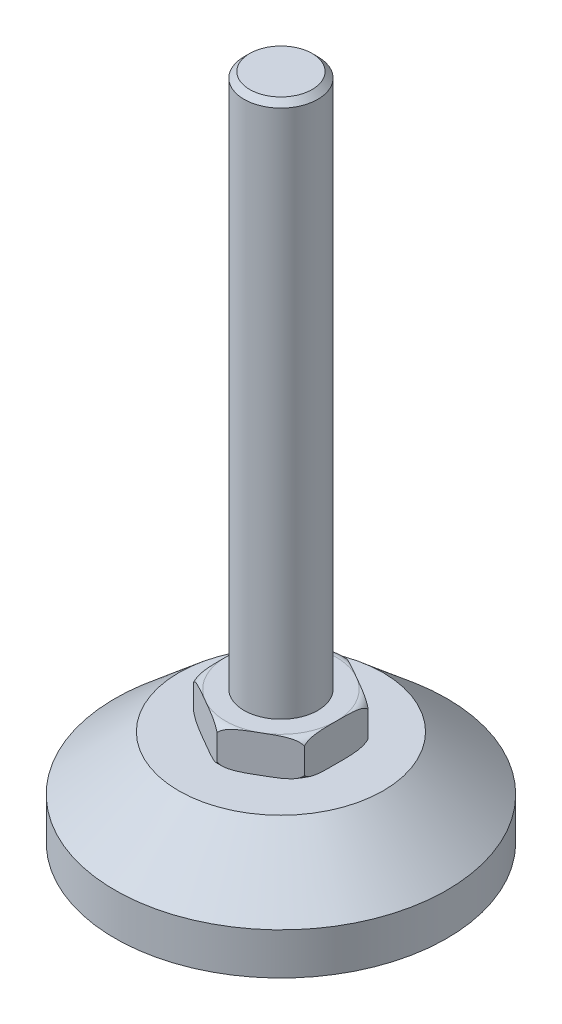
ISO-10303-21;
HEADER;
FILE_DESCRIPTION(('STEP AP214'),'2;1');
FILE_NAME('part.step','',(''),(''),'','','');
FILE_SCHEMA(('AUTOMOTIVE_DESIGN { 1 0 10303 214 1 1 1 1 }'));
ENDSEC;
DATA;
#1=APPLICATION_CONTEXT('core data for automotive mechanical design processes');
#2=APPLICATION_PROTOCOL_DEFINITION('international standard','automotive_design',2000,#1);
#3=PRODUCT_CONTEXT('',#1,'mechanical');
#4=PRODUCT('Part','Part','',(#3));
#5=PRODUCT_RELATED_PRODUCT_CATEGORY('part','',(#4));
#6=PRODUCT_DEFINITION_FORMATION('','',#4);
#7=PRODUCT_DEFINITION_CONTEXT('part definition',#1,'design');
#8=PRODUCT_DEFINITION('design','',#6,#7);
#9=PRODUCT_DEFINITION_SHAPE('','',#8);
#10=(LENGTH_UNIT() NAMED_UNIT(*) SI_UNIT(.MILLI.,.METRE.));
#11=(NAMED_UNIT(*) PLANE_ANGLE_UNIT() SI_UNIT($,.RADIAN.));
#12=(NAMED_UNIT(*) SI_UNIT($,.STERADIAN.) SOLID_ANGLE_UNIT());
#13=UNCERTAINTY_MEASURE_WITH_UNIT(LENGTH_MEASURE(1.E-05),#10,'distance_accuracy_value','');
#14=(GEOMETRIC_REPRESENTATION_CONTEXT(3) GLOBAL_UNCERTAINTY_ASSIGNED_CONTEXT((#13)) GLOBAL_UNIT_ASSIGNED_CONTEXT((#10,
#11,#12)) REPRESENTATION_CONTEXT('',''));
#15=CARTESIAN_POINT('',(0.,0.,0.));
#16=DIRECTION('',(0.,0.,1.));
#17=DIRECTION('',(1.,0.,0.));
#18=AXIS2_PLACEMENT_3D('',#15,#16,#17);
#19=CARTESIAN_POINT('',(0.,31.5,0.));
#20=DIRECTION('',(0.,-1.,0.));
#21=DIRECTION('',(0.,0.,-1.));
#22=AXIS2_PLACEMENT_3D('',#19,#20,#21);
#23=TOROIDAL_SURFACE('',#22,15.,2.5);
#24=CARTESIAN_POINT('',(-7.50000000000001,29.,-12.9903810567666));
#25=CARTESIAN_POINT('',(-8.96130139050577,29.,-12.1466983055909));
#26=CARTESIAN_POINT('',(-9.45168874238305,29.0056746595264,-11.8635730359774));
#27=CARTESIAN_POINT('',(-10.6339885096163,29.0193559843229,-11.1809719471024));
#28=CARTESIAN_POINT('',(-11.3995414098782,29.0890399843952,-10.7389797740573));
#29=CARTESIAN_POINT('',(-12.7132104172574,29.208615929015,-9.98053261902087));
#30=CARTESIAN_POINT('',(-13.580530579708,29.5478938005466,-9.47978508975643));
#31=CARTESIAN_POINT('',(-14.0128615715206,29.7170128237743,-9.2301786752544));
#32=CARTESIAN_POINT('',(-14.3513386318172,29.9459349697346,-9.03475885337765));
#33=CARTESIAN_POINT('',(-14.7576194955765,30.2207148532306,-8.80019248731963));
#34=CARTESIAN_POINT('',(-14.9999999999954,30.5698160017096,-8.66025403784707));
#35=B_SPLINE_CURVE_WITH_KNOTS('',2,(#24,#25,#26,#27,#28,#29,#30,#31,#32,#33,#34),.UNSPECIFIED.,
.F.,.F.,(3,2,2,2,2,3),(0.,0.25,0.5,0.785714285714286,0.892857142857143,1.),.UNSPECIFIED.);
#36=CARTESIAN_POINT('',(-7.5,29.,-12.9903810567666));
#37=VERTEX_POINT('',#36);
#38=CARTESIAN_POINT('',(-15.,30.5698160017029,-8.66025403784439));
#39=VERTEX_POINT('',#38);
#40=EDGE_CURVE('E358',#37,#39,#35,.T.);
#41=ORIENTED_EDGE('',*,*,#40,.F.);
#42=CARTESIAN_POINT('',(0.,29.,0.));
#43=DIRECTION('',(0.,-1.,0.));
#44=DIRECTION('',(0.,0.,-1.));
#45=AXIS2_PLACEMENT_3D('',#42,#43,#44);
#46=CIRCLE('',#45,15.);
#47=CARTESIAN_POINT('',(-15.,29.,0.));
#48=VERTEX_POINT('',#47);
#49=EDGE_CURVE('E638',#48,#37,#46,.T.);
#50=ORIENTED_EDGE('',*,*,#49,.F.);
#51=CARTESIAN_POINT('',(-15.,30.5698160017082,-8.66025403783797));
#52=CARTESIAN_POINT('',(-15.,30.1235587743501,-8.30248641241119));
#53=CARTESIAN_POINT('',(-15.,29.796986819349,-7.6325941078365));
#54=CARTESIAN_POINT('',(-15.,29.5436425126361,-7.11291261383249));
#55=CARTESIAN_POINT('',(-15.,29.3732258924531,-6.41584851671963));
#56=CARTESIAN_POINT('',(-15.,29.1765293571952,-5.61129029576918));
#57=CARTESIAN_POINT('',(-15.,29.0891008871721,-4.50357468180429));
#58=CARTESIAN_POINT('',(-15.,29.019380151676,-3.6202154361742));
#59=CARTESIAN_POINT('',(-15.,29.0056706848194,-2.25321956097198));
#60=CARTESIAN_POINT('',(-15.,28.9999999999998,-1.68778526370712));
#61=CARTESIAN_POINT('',(-15.,28.9999999999998,0.));
#62=B_SPLINE_CURVE_WITH_KNOTS('',2,(#51,#52,#53,#54,#55,#56,#57,#58,#59,#60,#61),.UNSPECIFIED.,
.F.,.F.,(3,2,2,2,2,3),(0.,0.142857142857143,0.285714285714286,0.5,0.75,1.),.UNSPECIFIED.);
#63=EDGE_CURVE('E658',#39,#48,#62,.T.);
#64=ORIENTED_EDGE('',*,*,#63,.F.);
#65=EDGE_LOOP('',(#41,#50,#64));
#66=FACE_BOUND('',#65,.T.);
#67=ADVANCED_FACE('F41',(#66),#23,.T.);
#68=CARTESIAN_POINT('',(15.,29.,8.66025403784439));
#69=DIRECTION('',(1.,0.,0.));
#70=DIRECTION('',(0.,1.,0.));
#71=AXIS2_PLACEMENT_3D('',#68,#69,#70);
#72=PLANE('',#71);
#73=CARTESIAN_POINT('',(15.,37.4301839982891,-8.66025403784011));
#74=CARTESIAN_POINT('',(15.,37.8764412256418,-8.30248641241896));
#75=CARTESIAN_POINT('',(15.,38.2030131806497,-7.63259410783916));
#76=CARTESIAN_POINT('',(15.,38.4563574873402,-7.11291261388801));
#77=CARTESIAN_POINT('',(15.,38.6267741075463,-6.41584851672196));
#78=CARTESIAN_POINT('',(15.,38.82347064278,-5.61129029591879));
#79=CARTESIAN_POINT('',(15.,38.9108991128277,-4.50357468180597));
#80=CARTESIAN_POINT('',(15.,38.9806198483089,-3.62021543649595));
#81=CARTESIAN_POINT('',(15.,38.9943293151806,-2.25321956097277));
#82=CARTESIAN_POINT('',(15.,39.0000000000002,-1.68778526420001));
#83=CARTESIAN_POINT('',(15.,39.0000000000002,0.));
#84=B_SPLINE_CURVE_WITH_KNOTS('',2,(#73,#74,#75,#76,#77,#78,#79,#80,#81,#82,#83),.UNSPECIFIED.,
.F.,.F.,(3,2,2,2,2,3),(0.,0.142857142857143,0.285714285714286,0.5,0.75,1.),.UNSPECIFIED.);
#85=CARTESIAN_POINT('',(14.9999999999908,37.4301839982971,-8.66025403784971));
#86=VERTEX_POINT('',#85);
#87=CARTESIAN_POINT('',(15.,39.,0.));
#88=VERTEX_POINT('',#87);
#89=EDGE_CURVE('E668',#86,#88,#84,.T.);
#90=ORIENTED_EDGE('',*,*,#89,.T.);
#91=CARTESIAN_POINT('',(15.,39.0000000000002,0.));
#92=CARTESIAN_POINT('',(15.,39.0000000000002,1.68868131309375));
#93=CARTESIAN_POINT('',(15.,38.9943077207282,2.25537113221989));
#94=CARTESIAN_POINT('',(15.,38.9877600626021,2.9072174352275));
#95=CARTESIAN_POINT('',(15.,38.9718431618494,3.38252569359753));
#96=CARTESIAN_POINT('',(15.,38.9514689066876,3.9909388443159));
#97=CARTESIAN_POINT('',(15.,38.9104997438894,4.50862793481098));
#98=CARTESIAN_POINT('',(15.,38.8550176895906,5.20970289624456));
#99=CARTESIAN_POINT('',(15.,38.7555933813465,5.78851901899738));
#100=CARTESIAN_POINT('',(15.,38.6367099523602,6.48061984062342));
#101=CARTESIAN_POINT('',(15.,38.4477255875539,7.03388595719448));
#102=CARTESIAN_POINT('',(15.,38.2773364383082,7.53271316443804));
#103=CARTESIAN_POINT('',(15.,38.0500738681571,7.91781339707679));
#104=CARTESIAN_POINT('',(15.,37.7751322828114,8.38370651976896));
#105=CARTESIAN_POINT('',(15.,37.4301839982838,8.66025403784439));
#106=B_SPLINE_CURVE_WITH_KNOTS('',2,(#91,#92,#93,#94,#95,#96,#97,#98,#99,#100,#101,#102,#103,
#104,#105),.UNSPECIFIED.,.F.,.F.,(3,2,2,2,2,2,2,3),(0.,0.25,0.375,0.5,0.642857142857143,
0.785714285714286,0.892857142857143,1.),.UNSPECIFIED.);
#107=CARTESIAN_POINT('',(15.,37.4301839982838,8.66025403784439));
#108=VERTEX_POINT('',#107);
#109=EDGE_CURVE('E520',#88,#108,#106,.T.);
#110=ORIENTED_EDGE('',*,*,#109,.T.);
#111=DIRECTION('',(0.,1.,0.));
#112=VECTOR('',#111,1.);
#113=CARTESIAN_POINT('',(15.,29.,8.66025403784439));
#114=LINE('',#113,#112);
#115=CARTESIAN_POINT('',(15.,30.5698160017164,8.66025403784451));
#116=VERTEX_POINT('',#115);
#117=EDGE_CURVE('E430',#116,#108,#114,.T.);
#118=ORIENTED_EDGE('',*,*,#117,.F.);
#119=CARTESIAN_POINT('',(15.,30.5698160017164,8.66025403784451));
#120=CARTESIAN_POINT('',(15.,30.1235587743544,8.30248641241847));
#121=CARTESIAN_POINT('',(15.,29.7969868193529,7.63259410784463));
#122=CARTESIAN_POINT('',(15.,29.5436425126525,7.1129126138674));
#123=CARTESIAN_POINT('',(15.,29.3732258924549,6.41584851672692));
#124=CARTESIAN_POINT('',(15.,29.1765293571993,5.61129029582287));
#125=CARTESIAN_POINT('',(15.,29.0891008871726,4.50357468180956));
#126=CARTESIAN_POINT('',(15.,29.0193801516759,3.62021543617154));
#127=CARTESIAN_POINT('',(15.,29.0056706848194,2.2532195609746));
#128=CARTESIAN_POINT('',(15.,28.9999999999998,1.68778526370629));
#129=CARTESIAN_POINT('',(15.,28.9999999999998,0.));
#130=B_SPLINE_CURVE_WITH_KNOTS('',2,(#119,#120,#121,#122,#123,#124,#125,#126,#127,#128,#129),
.UNSPECIFIED.,.F.,.F.,(3,2,2,2,2,3),(0.,0.142857142857143,0.285714285714286,0.5,0.75,1.),.UNSPECIFIED.);
#131=CARTESIAN_POINT('',(15.,29.,0.));
#132=VERTEX_POINT('',#131);
#133=EDGE_CURVE('E51',#116,#132,#130,.T.);
#134=ORIENTED_EDGE('',*,*,#133,.T.);
#135=CARTESIAN_POINT('',(15.,28.9999999999998,0.));
#136=CARTESIAN_POINT('',(15.,28.9999999999998,-1.68868131309341));
#137=CARTESIAN_POINT('',(15.,29.0056922792719,-2.25537113221989));
#138=CARTESIAN_POINT('',(15.,29.0122399373947,-2.90721743490585));
#139=CARTESIAN_POINT('',(15.,29.0281568381505,-3.38252569359753));
#140=CARTESIAN_POINT('',(15.,29.0485310932981,-3.99093884417661));
#141=CARTESIAN_POINT('',(15.,29.0895002561106,-4.50862793481097));
#142=CARTESIAN_POINT('',(15.,29.1449823104177,-5.20970289629233));
#143=CARTESIAN_POINT('',(15.,29.2444066186536,-5.78851901899739));
#144=CARTESIAN_POINT('',(15.,29.3632900476379,-6.48061984061286));
#145=CARTESIAN_POINT('',(15.,29.5522744124461,-7.03388595719446));
#146=CARTESIAN_POINT('',(15.,29.7226635616862,-7.53271316442616));
#147=CARTESIAN_POINT('',(15.,29.9499261318429,-7.91781339707681));
#148=CARTESIAN_POINT('',(15.,30.2248677171852,-8.38370651976601));
#149=CARTESIAN_POINT('',(15.,30.5698160017162,-8.66025403784441));
#150=B_SPLINE_CURVE_WITH_KNOTS('',2,(#135,#136,#137,#138,#139,#140,#141,#142,#143,#144,#145,
#146,#147,#148,#149),.UNSPECIFIED.,.F.,.F.,(3,2,2,2,2,2,2,3),(0.,0.25,0.375,0.5,
0.642857142857143,0.785714285714286,0.892857142857143,1.),.UNSPECIFIED.);
#151=CARTESIAN_POINT('',(15.,30.5698160017162,-8.66025403784439));
#152=VERTEX_POINT('',#151);
#153=EDGE_CURVE('E12',#132,#152,#150,.T.);
#154=ORIENTED_EDGE('',*,*,#153,.T.);
#155=DIRECTION('',(0.,1.,0.));
#156=VECTOR('',#155,1.);
#157=CARTESIAN_POINT('',(15.,29.,-8.66025403784439));
#158=LINE('',#157,#156);
#159=EDGE_CURVE('E927',#152,#86,#158,.T.);
#160=ORIENTED_EDGE('',*,*,#159,.T.);
#161=EDGE_LOOP('',(#90,#110,#118,#134,#154,#160));
#162=FACE_BOUND('',#161,.T.);
#163=ADVANCED_FACE('F341',(#162),#72,.T.);
#164=CARTESIAN_POINT('',(-15.,29.,8.66025403784439));
#165=DIRECTION('',(-0.5,0.,0.866025403784439));
#166=DIRECTION('',(0.,1.,0.));
#167=AXIS2_PLACEMENT_3D('',#164,#165,#166);
#168=PLANE('',#167);
#169=DIRECTION('',(0.,1.,0.));
#170=VECTOR('',#169,1.);
#171=CARTESIAN_POINT('',(0.,29.,17.3205080756888));
#172=LINE('',#171,#170);
#173=CARTESIAN_POINT('',(0.,30.5698160017031,17.3205080756835));
#174=VERTEX_POINT('',#173);
#175=CARTESIAN_POINT('',(0.,37.430183998297,17.3205080756835));
#176=VERTEX_POINT('',#175);
#177=EDGE_CURVE('E612',#174,#176,#172,.T.);
#178=ORIENTED_EDGE('',*,*,#177,.T.);
#179=CARTESIAN_POINT('',(-1.87523607753093E-12,37.4301839982946,17.3205080756877));
#180=CARTESIAN_POINT('',(-0.309841605455377,37.8764495119477,17.141620941373));
#181=CARTESIAN_POINT('',(-0.892990092455252,38.2048222598795,16.8049400054261));
#182=CARTESIAN_POINT('',(-1.34394496490091,38.4587563675029,16.5445810884272));
#183=CARTESIAN_POINT('',(-1.9503072146466,38.6284041186055,16.1944976803101));
#184=CARTESIAN_POINT('',(-2.65306012488065,38.8250200043273,15.7887630984127));
#185=CARTESIAN_POINT('',(-3.60577548879402,38.911443157457,15.2387126265962));
#186=CARTESIAN_POINT('',(-4.05122123702597,38.9518506365097,14.9815344039451));
#187=CARTESIAN_POINT('',(-4.57715634103826,38.9720749648833,14.6778856300673));
#188=CARTESIAN_POINT('',(-4.98741035674131,38.9878508883135,14.441025363665));
#189=CARTESIAN_POINT('',(-5.55070792674983,38.9943530405408,14.1158053599868));
#190=CARTESIAN_POINT('',(-5.84799923241022,38.997784678503,13.944164144636));
#191=CARTESIAN_POINT('',(-6.20031205747897,38.9991469859418,13.7407562402436));
#192=CARTESIAN_POINT('',(-6.42091409200853,39.,13.6133915962242));
#193=CARTESIAN_POINT('',(-7.49999999999998,39.,12.9903810567666));
#194=B_SPLINE_CURVE_WITH_KNOTS('',2,(#179,#180,#181,#182,#183,#184,#185,#186,#187,#188,#189,
#190,#191,#192,#193),.UNSPECIFIED.,.F.,.F.,(3,2,2,2,2,2,2,3),(0.,0.142857142857143,
0.285714285714286,0.5,0.625,0.75,0.833333333333333,1.),.UNSPECIFIED.);
#195=CARTESIAN_POINT('',(-7.5,39.,12.9903810567666));
#196=VERTEX_POINT('',#195);
#197=EDGE_CURVE('E513',#176,#196,#194,.T.);
#198=ORIENTED_EDGE('',*,*,#197,.T.);
#199=CARTESIAN_POINT('',(-7.49999999999998,39.,12.9903810567666));
#200=CARTESIAN_POINT('',(-8.96130138988979,39.,12.1466983059465));
#201=CARTESIAN_POINT('',(-9.45168874238303,38.9943253404737,11.8635730359774));
#202=CARTESIAN_POINT('',(-10.6339885094595,38.9806440156962,11.180971947193));
#203=CARTESIAN_POINT('',(-11.3995414098781,38.9109600156048,10.7389797740574));
#204=CARTESIAN_POINT('',(-12.7132104172455,38.7913840709778,9.98053261902774));
#205=CARTESIAN_POINT('',(-13.5805305797077,38.4521061994536,9.4797850897566));
#206=CARTESIAN_POINT('',(-14.0128615715187,38.2829871762324,9.23017867525549));
#207=CARTESIAN_POINT('',(-14.351338631817,38.0540650302656,9.03475885337775));
#208=CARTESIAN_POINT('',(-14.7576194955849,37.7792851467572,8.80019248731476));
#209=CARTESIAN_POINT('',(-14.9999999999954,37.4301839982904,8.66025403784705));
#210=B_SPLINE_CURVE_WITH_KNOTS('',2,(#199,#200,#201,#202,#203,#204,#205,#206,#207,#208,#209),
.UNSPECIFIED.,.F.,.F.,(3,2,2,2,2,3),(0.,0.25,0.5,0.785714285714286,0.892857142857143,1.),.UNSPECIFIED.);
#211=CARTESIAN_POINT('',(-15.,37.4301839982836,8.6602540378445));
#212=VERTEX_POINT('',#211);
#213=EDGE_CURVE('E276',#196,#212,#210,.T.);
#214=ORIENTED_EDGE('',*,*,#213,.T.);
#215=DIRECTION('',(0.,1.,0.));
#216=VECTOR('',#215,1.);
#217=CARTESIAN_POINT('',(-15.,29.,8.66025403784439));
#218=LINE('',#217,#216);
#219=CARTESIAN_POINT('',(-15.,30.5698160017162,8.66025403784439));
#220=VERTEX_POINT('',#219);
#221=EDGE_CURVE('E514',#220,#212,#218,.T.);
#222=ORIENTED_EDGE('',*,*,#221,.F.);
#223=CARTESIAN_POINT('',(-14.9999999999916,30.5698160017041,8.66025403784924));
#224=CARTESIAN_POINT('',(-14.690158394569,30.1235504880725,8.83914117214613));
#225=CARTESIAN_POINT('',(-14.1070099075446,29.7951777401203,9.17582210810721));
#226=CARTESIAN_POINT('',(-13.6560550351455,29.5412436325182,9.43618102507918));
#227=CARTESIAN_POINT('',(-13.0496927853532,29.3715958813944,9.78626443322318));
#228=CARTESIAN_POINT('',(-12.3469398751431,29.1749799956699,10.1919990151068));
#229=CARTESIAN_POINT('',(-11.3942245112058,29.0885568425429,10.7420494869371));
#230=CARTESIAN_POINT('',(-10.9487787630079,29.0481493634957,10.9992277095685));
#231=CARTESIAN_POINT('',(-10.4228436589616,29.0279250351167,11.3028764834659));
#232=CARTESIAN_POINT('',(-10.0125896435164,29.0121491116932,11.5397367497193));
#233=CARTESIAN_POINT('',(-9.44929207325009,29.0056469594592,11.8649567535464));
#234=CARTESIAN_POINT('',(-9.15200076835931,29.0022153215039,12.0365979684529));
#235=CARTESIAN_POINT('',(-8.79968794252098,29.0008530140582,12.2400058732896));
#236=CARTESIAN_POINT('',(-8.57908590863338,29.,12.3673705169384));
#237=CARTESIAN_POINT('',(-7.49999999999998,29.,12.9903810567666));
#238=B_SPLINE_CURVE_WITH_KNOTS('',2,(#223,#224,#225,#226,#227,#228,#229,#230,#231,#232,#233,
#234,#235,#236,#237),.UNSPECIFIED.,.F.,.F.,(3,2,2,2,2,2,2,3),(0.,0.142857142857143,
0.285714285714286,0.5,0.625,0.75,0.833333333333333,1.),.UNSPECIFIED.);
#239=CARTESIAN_POINT('',(-7.5,29.,12.9903810567666));
#240=VERTEX_POINT('',#239);
#241=EDGE_CURVE('E622',#220,#240,#238,.T.);
#242=ORIENTED_EDGE('',*,*,#241,.T.);
#243=CARTESIAN_POINT('',(-7.49999999999998,29.,12.9903810567666));
#244=CARTESIAN_POINT('',(-6.03869861010004,29.,13.8340638075925));
#245=CARTESIAN_POINT('',(-5.54831125761696,29.0056746595263,14.1171890775558));
#246=CARTESIAN_POINT('',(-4.36601149051444,29.0193559843044,14.7997901663553));
#247=CARTESIAN_POINT('',(-3.60045859012182,29.0890399843952,15.2417823394758));
#248=CARTESIAN_POINT('',(-2.28678958276282,29.2086159290245,16.0002294945006));
#249=CARTESIAN_POINT('',(-1.41946942029201,29.5478938005466,16.5009770237767));
#250=CARTESIAN_POINT('',(-0.987138428498457,29.7170128237581,16.7505834382678));
#251=CARTESIAN_POINT('',(-0.648661368182727,29.9459349697346,16.9460032601556));
#252=CARTESIAN_POINT('',(-0.242380504419616,30.220714853237,17.1805696262158));
#253=CARTESIAN_POINT('',(-1.13971332371676E-12,30.5698160017096,17.3205080756881));
#254=B_SPLINE_CURVE_WITH_KNOTS('',2,(#243,#244,#245,#246,#247,#248,#249,#250,#251,#252,#253),
.UNSPECIFIED.,.F.,.F.,(3,2,2,2,2,3),(0.,0.25,0.5,0.785714285714286,0.892857142857143,1.),.UNSPECIFIED.);
#255=EDGE_CURVE('E450',#240,#174,#254,.T.);
#256=ORIENTED_EDGE('',*,*,#255,.T.);
#257=EDGE_LOOP('',(#178,#198,#214,#222,#242,#256));
#258=FACE_BOUND('',#257,.T.);
#259=ADVANCED_FACE('F457',(#258),#168,.T.);
#260=CARTESIAN_POINT('',(0.,31.5,0.));
#261=DIRECTION('',(0.,-1.,0.));
#262=DIRECTION('',(0.,0.,-1.));
#263=AXIS2_PLACEMENT_3D('',#260,#261,#262);
#264=TOROIDAL_SURFACE('',#263,15.,2.5);
#265=CARTESIAN_POINT('',(0.,29.,0.));
#266=DIRECTION('',(0.,-1.,0.));
#267=DIRECTION('',(0.,0.,-1.));
#268=AXIS2_PLACEMENT_3D('',#265,#266,#267);
#269=CIRCLE('',#268,15.);
#270=CARTESIAN_POINT('',(7.5,29.,-12.9903810567666));
#271=VERTEX_POINT('',#270);
#272=EDGE_CURVE('E639',#271,#132,#269,.T.);
#273=ORIENTED_EDGE('',*,*,#272,.F.);
#274=CARTESIAN_POINT('',(14.9999999999916,30.5698160017041,-8.66025403784924));
#275=CARTESIAN_POINT('',(14.690158394569,30.1235504880725,-8.83914117214613));
#276=CARTESIAN_POINT('',(14.1070099075446,29.7951777401203,-9.17582210810721));
#277=CARTESIAN_POINT('',(13.6560550351456,29.5412436325182,-9.43618102507913));
#278=CARTESIAN_POINT('',(13.0496927853532,29.3715958813944,-9.78626443322318));
#279=CARTESIAN_POINT('',(12.346939875143,29.1749799956699,-10.1919990151068));
#280=CARTESIAN_POINT('',(11.3942245112058,29.0885568425429,-10.7420494869371));
#281=CARTESIAN_POINT('',(10.9487787630079,29.0481493634957,-10.9992277095685));
#282=CARTESIAN_POINT('',(10.4228436589616,29.0279250351167,-11.3028764834659));
#283=CARTESIAN_POINT('',(10.0125896435164,29.0121491116932,-11.5397367497193));
#284=CARTESIAN_POINT('',(9.44929207325009,29.0056469594592,-11.8649567535464));
#285=CARTESIAN_POINT('',(9.15200076835931,29.0022153215039,-12.0365979684529));
#286=CARTESIAN_POINT('',(8.79968794252098,29.0008530140582,-12.2400058732896));
#287=CARTESIAN_POINT('',(8.57908590863338,29.,-12.3673705169384));
#288=CARTESIAN_POINT('',(7.49999999999998,29.,-12.9903810567666));
#289=B_SPLINE_CURVE_WITH_KNOTS('',2,(#274,#275,#276,#277,#278,#279,#280,#281,#282,#283,#284,
#285,#286,#287,#288),.UNSPECIFIED.,.F.,.F.,(3,2,2,2,2,2,2,3),(0.,0.142857142857143,
0.285714285714286,0.5,0.625,0.75,0.833333333333333,1.),.UNSPECIFIED.);
#290=EDGE_CURVE('E377',#152,#271,#289,.T.);
#291=ORIENTED_EDGE('',*,*,#290,.F.);
#292=ORIENTED_EDGE('',*,*,#153,.F.);
#293=EDGE_LOOP('',(#273,#291,#292));
#294=FACE_BOUND('',#293,.T.);
#295=ADVANCED_FACE('F467',(#294),#264,.T.);
#296=CARTESIAN_POINT('',(0.,31.5,0.));
#297=DIRECTION('',(0.,-1.,0.));
#298=DIRECTION('',(0.,0.,-1.));
#299=AXIS2_PLACEMENT_3D('',#296,#297,#298);
#300=TOROIDAL_SURFACE('',#299,15.,2.5);
#301=CARTESIAN_POINT('',(0.,29.,0.));
#302=DIRECTION('',(0.,-1.,0.));
#303=DIRECTION('',(0.,0.,-1.));
#304=AXIS2_PLACEMENT_3D('',#301,#302,#303);
#305=CIRCLE('',#304,15.);
#306=CARTESIAN_POINT('',(7.5,29.,12.9903810567666));
#307=VERTEX_POINT('',#306);
#308=EDGE_CURVE('E632',#132,#307,#305,.T.);
#309=ORIENTED_EDGE('',*,*,#308,.F.);
#310=ORIENTED_EDGE('',*,*,#133,.F.);
#311=CARTESIAN_POINT('',(7.50000000000001,29.,12.9903810567666));
#312=CARTESIAN_POINT('',(8.961301390667,29.,12.1466983054978));
#313=CARTESIAN_POINT('',(9.45168874238305,29.0056746595264,11.8635730359774));
#314=CARTESIAN_POINT('',(10.6339885097544,29.019355984329,11.1809719470227));
#315=CARTESIAN_POINT('',(11.3995414098782,29.0890399843952,10.7389797740573));
#316=CARTESIAN_POINT('',(12.7132104172981,29.2086159290298,9.98053261899738));
#317=CARTESIAN_POINT('',(13.580530579708,29.5478938005466,9.47978508975645));
#318=CARTESIAN_POINT('',(14.0128615715255,29.7170128237767,9.2301786752516));
#319=CARTESIAN_POINT('',(14.3513386318172,29.9459349697346,9.03475885337765));
#320=CARTESIAN_POINT('',(14.7576194955778,30.2207148532325,8.80019248731887));
#321=CARTESIAN_POINT('',(14.9999999999954,30.5698160017096,8.66025403784707));
#322=B_SPLINE_CURVE_WITH_KNOTS('',2,(#311,#312,#313,#314,#315,#316,#317,#318,#319,#320,#321),
.UNSPECIFIED.,.F.,.F.,(3,2,2,2,2,3),(0.,0.25,0.5,0.785714285714286,0.892857142857143,1.),.UNSPECIFIED.);
#323=EDGE_CURVE('E329',#307,#116,#322,.T.);
#324=ORIENTED_EDGE('',*,*,#323,.F.);
#325=EDGE_LOOP('',(#309,#310,#324));
#326=FACE_BOUND('',#325,.T.);
#327=ADVANCED_FACE('F564',(#326),#300,.T.);
#328=CARTESIAN_POINT('',(0.,31.5,0.));
#329=DIRECTION('',(0.,-1.,0.));
#330=DIRECTION('',(0.,0.,-1.));
#331=AXIS2_PLACEMENT_3D('',#328,#329,#330);
#332=TOROIDAL_SURFACE('',#331,15.,2.5);
#333=CARTESIAN_POINT('',(0.,29.,0.));
#334=DIRECTION('',(0.,-1.,0.));
#335=DIRECTION('',(0.,0.,-1.));
#336=AXIS2_PLACEMENT_3D('',#333,#334,#335);
#337=CIRCLE('',#336,15.);
#338=EDGE_CURVE('E157',#307,#240,#337,.T.);
#339=ORIENTED_EDGE('',*,*,#338,.F.);
#340=CARTESIAN_POINT('',(1.73179315369426E-12,30.5698160017064,17.3205080756878));
#341=CARTESIAN_POINT('',(0.309841605447004,30.1235504880625,17.1416209413778));
#342=CARTESIAN_POINT('',(0.892990092455255,29.7951777401205,16.8049400054261));
#343=CARTESIAN_POINT('',(1.34394496489584,29.5412436324957,16.5445810884301));
#344=CARTESIAN_POINT('',(1.9503072146466,29.3715958813945,16.1944976803101));
#345=CARTESIAN_POINT('',(2.65306012488285,29.1749799956754,15.7887630984114));
#346=CARTESIAN_POINT('',(3.60577548879403,29.088556842543,15.2387126265962));
#347=CARTESIAN_POINT('',(4.05122123700344,29.0481493634911,14.9815344039581));
#348=CARTESIAN_POINT('',(4.57715634103827,29.0279250351167,14.6778856300674));
#349=CARTESIAN_POINT('',(4.98741035666497,29.0121491116895,14.4410253637092));
#350=CARTESIAN_POINT('',(5.55070792674984,29.0056469594592,14.1158053599868));
#351=CARTESIAN_POINT('',(5.84799923191412,29.0022153215016,13.9441641449225));
#352=CARTESIAN_POINT('',(6.20031205747898,29.0008530140582,13.7407562402436));
#353=CARTESIAN_POINT('',(6.42091409156896,29.,13.613391596478));
#354=CARTESIAN_POINT('',(7.50000000000001,29.,12.9903810567666));
#355=B_SPLINE_CURVE_WITH_KNOTS('',2,(#340,#341,#342,#343,#344,#345,#346,#347,#348,#349,#350,
#351,#352,#353,#354),.UNSPECIFIED.,.F.,.F.,(3,2,2,2,2,2,2,3),(0.,0.142857142857143,
0.285714285714286,0.5,0.625,0.75,0.833333333333333,1.),.UNSPECIFIED.);
#356=EDGE_CURVE('E613',#174,#307,#355,.T.);
#357=ORIENTED_EDGE('',*,*,#356,.F.);
#358=ORIENTED_EDGE('',*,*,#255,.F.);
#359=EDGE_LOOP('',(#339,#357,#358));
#360=FACE_BOUND('',#359,.T.);
#361=ADVANCED_FACE('F566',(#360),#332,.T.);
#362=CARTESIAN_POINT('',(0.,31.5,0.));
#363=DIRECTION('',(0.,-1.,0.));
#364=DIRECTION('',(0.,0.,-1.));
#365=AXIS2_PLACEMENT_3D('',#362,#363,#364);
#366=TOROIDAL_SURFACE('',#365,15.,2.5);
#367=CARTESIAN_POINT('',(-15.,28.9999999999998,0.));
#368=CARTESIAN_POINT('',(-15.,28.9999999999998,1.68868131255781));
#369=CARTESIAN_POINT('',(-15.,29.0056922792718,2.25537113221989));
#370=CARTESIAN_POINT('',(-15.,29.0122399373858,2.90721743463953));
#371=CARTESIAN_POINT('',(-15.,29.0281568381505,3.38252569359753));
#372=CARTESIAN_POINT('',(-15.,29.0485310932992,3.99093884421051));
#373=CARTESIAN_POINT('',(-15.,29.0895002561106,4.50862793481099));
#374=CARTESIAN_POINT('',(-15.,29.144982310425,5.20970289635765));
#375=CARTESIAN_POINT('',(-15.,29.2444066186536,5.78851901899739));
#376=CARTESIAN_POINT('',(-15.,29.3632900476466,6.48061984063631));
#377=CARTESIAN_POINT('',(-15.,29.5522744124461,7.03388595719446));
#378=CARTESIAN_POINT('',(-15.,29.7226635616819,7.53271316441496));
#379=CARTESIAN_POINT('',(-15.,29.9499261318429,7.91781339707681));
#380=CARTESIAN_POINT('',(-15.,30.2248677171799,8.38370651976176));
#381=CARTESIAN_POINT('',(-15.,30.5698160017162,8.66025403784441));
#382=B_SPLINE_CURVE_WITH_KNOTS('',2,(#367,#368,#369,#370,#371,#372,#373,#374,#375,#376,#377,
#378,#379,#380,#381),.UNSPECIFIED.,.F.,.F.,(3,2,2,2,2,2,2,3),(0.,0.25,0.375,0.5,
0.642857142857143,0.785714285714286,0.892857142857143,1.),.UNSPECIFIED.);
#383=EDGE_CURVE('E636',#48,#220,#382,.T.);
#384=ORIENTED_EDGE('',*,*,#383,.F.);
#385=CARTESIAN_POINT('',(0.,29.,0.));
#386=DIRECTION('',(0.,-1.,0.));
#387=DIRECTION('',(0.,0.,-1.));
#388=AXIS2_PLACEMENT_3D('',#385,#386,#387);
#389=CIRCLE('',#388,15.);
#390=EDGE_CURVE('E154',#240,#48,#389,.T.);
#391=ORIENTED_EDGE('',*,*,#390,.F.);
#392=ORIENTED_EDGE('',*,*,#241,.F.);
#393=EDGE_LOOP('',(#384,#391,#392));
#394=FACE_BOUND('',#393,.T.);
#395=ADVANCED_FACE('F468',(#394),#366,.T.);
#396=CARTESIAN_POINT('',(0.,39.,0.));
#397=DIRECTION('',(0.,1.,0.));
#398=DIRECTION('',(1.,0.,0.));
#399=AXIS2_PLACEMENT_3D('',#396,#397,#398);
#400=PLANE('',#399);
#401=CARTESIAN_POINT('',(0.,39.,0.));
#402=DIRECTION('',(0.,1.,0.));
#403=DIRECTION('',(0.,0.,1.));
#404=AXIS2_PLACEMENT_3D('',#401,#402,#403);
#405=CIRCLE('',#404,10.);
#406=CARTESIAN_POINT('',(0.,39.,10.));
#407=VERTEX_POINT('',#406);
#408=EDGE_CURVE('E57',#407,#407,#405,.T.);
#409=ORIENTED_EDGE('',*,*,#408,.F.);
#410=EDGE_LOOP('',(#409));
#411=FACE_BOUND('',#410,.T.);
#412=CARTESIAN_POINT('',(0.,39.,0.));
#413=DIRECTION('',(0.,-1.,0.));
#414=DIRECTION('',(0.,0.,-1.));
#415=AXIS2_PLACEMENT_3D('',#412,#413,#414);
#416=CIRCLE('',#415,15.);
#417=CARTESIAN_POINT('',(7.5,39.,12.9903810567666));
#418=VERTEX_POINT('',#417);
#419=EDGE_CURVE('E507',#88,#418,#416,.T.);
#420=ORIENTED_EDGE('',*,*,#419,.F.);
#421=CARTESIAN_POINT('',(0.,39.,0.));
#422=DIRECTION('',(0.,-1.,0.));
#423=DIRECTION('',(0.,0.,-1.));
#424=AXIS2_PLACEMENT_3D('',#421,#422,#423);
#425=CIRCLE('',#424,15.);
#426=CARTESIAN_POINT('',(7.5,39.,-12.9903810567666));
#427=VERTEX_POINT('',#426);
#428=EDGE_CURVE('E275',#427,#88,#425,.T.);
#429=ORIENTED_EDGE('',*,*,#428,.F.);
#430=CARTESIAN_POINT('',(0.,39.,0.));
#431=DIRECTION('',(0.,-1.,0.));
#432=DIRECTION('',(0.,0.,-1.));
#433=AXIS2_PLACEMENT_3D('',#430,#431,#432);
#434=CIRCLE('',#433,15.);
#435=CARTESIAN_POINT('',(-7.5,39.,-12.9903810567666));
#436=VERTEX_POINT('',#435);
#437=EDGE_CURVE('E419',#436,#427,#434,.T.);
#438=ORIENTED_EDGE('',*,*,#437,.F.);
#439=CARTESIAN_POINT('',(0.,39.,0.));
#440=DIRECTION('',(0.,-1.,0.));
#441=DIRECTION('',(0.,0.,-1.));
#442=AXIS2_PLACEMENT_3D('',#439,#440,#441);
#443=CIRCLE('',#442,15.);
#444=CARTESIAN_POINT('',(-15.,39.,0.));
#445=VERTEX_POINT('',#444);
#446=EDGE_CURVE('E268',#445,#436,#443,.T.);
#447=ORIENTED_EDGE('',*,*,#446,.F.);
#448=CARTESIAN_POINT('',(0.,39.,0.));
#449=DIRECTION('',(0.,-1.,0.));
#450=DIRECTION('',(0.,0.,-1.));
#451=AXIS2_PLACEMENT_3D('',#448,#449,#450);
#452=CIRCLE('',#451,15.);
#453=EDGE_CURVE('E500',#196,#445,#452,.T.);
#454=ORIENTED_EDGE('',*,*,#453,.F.);
#455=CARTESIAN_POINT('',(0.,39.,0.));
#456=DIRECTION('',(0.,-1.,0.));
#457=DIRECTION('',(0.,0.,-1.));
#458=AXIS2_PLACEMENT_3D('',#455,#456,#457);
#459=CIRCLE('',#458,15.);
#460=EDGE_CURVE('E510',#418,#196,#459,.T.);
#461=ORIENTED_EDGE('',*,*,#460,.F.);
#462=EDGE_LOOP('',(#420,#429,#438,#447,#454,#461));
#463=FACE_BOUND('',#462,.T.);
#464=ADVANCED_FACE('F212',(#411,#463),#400,.T.);
#465=CARTESIAN_POINT('',(0.,-50.,0.));
#466=DIRECTION('',(0.,1.,0.));
#467=DIRECTION('',(0.,0.,-1.));
#468=AXIS2_PLACEMENT_3D('',#465,#466,#467);
#469=CYLINDRICAL_SURFACE('',#468,10.);
#470=ORIENTED_EDGE('',*,*,#408,.T.);
#471=EDGE_LOOP('',(#470));
#472=FACE_BOUND('',#471,.T.);
#473=CARTESIAN_POINT('',(0.,182.4665,0.));
#474=DIRECTION('',(0.,-1.,0.));
#475=DIRECTION('',(0.,0.,-1.));
#476=AXIS2_PLACEMENT_3D('',#473,#474,#475);
#477=CIRCLE('',#476,10.);
#478=CARTESIAN_POINT('',(0.,182.4665,-10.));
#479=VERTEX_POINT('',#478);
#480=EDGE_CURVE('E45',#479,#479,#477,.T.);
#481=ORIENTED_EDGE('',*,*,#480,.T.);
#482=EDGE_LOOP('',(#481));
#483=FACE_BOUND('',#482,.T.);
#484=ADVANCED_FACE('F143',(#472,#483),#469,.T.);
#485=CARTESIAN_POINT('',(0.,36.5,0.));
#486=DIRECTION('',(0.,-1.,0.));
#487=DIRECTION('',(0.,0.,-1.));
#488=AXIS2_PLACEMENT_3D('',#485,#486,#487);
#489=TOROIDAL_SURFACE('',#488,15.,2.5);
#490=CARTESIAN_POINT('',(7.49999999999998,39.,-12.9903810567666));
#491=CARTESIAN_POINT('',(8.96130138988979,39.,-12.1466983059465));
#492=CARTESIAN_POINT('',(9.45168874238303,38.9943253404737,-11.8635730359774));
#493=CARTESIAN_POINT('',(10.6339885094595,38.9806440156962,-11.180971947193));
#494=CARTESIAN_POINT('',(11.3995414098781,38.9109600156048,-10.7389797740574));
#495=CARTESIAN_POINT('',(12.7132104172455,38.7913840709778,-9.98053261902774));
#496=CARTESIAN_POINT('',(13.5805305797077,38.4521061994536,-9.4797850897566));
#497=CARTESIAN_POINT('',(14.0128615715187,38.2829871762324,-9.23017867525549));
#498=CARTESIAN_POINT('',(14.351338631817,38.0540650302656,-9.03475885337775));
#499=CARTESIAN_POINT('',(14.7576194955849,37.7792851467572,-8.80019248731476));
#500=CARTESIAN_POINT('',(14.9999999999954,37.4301839982904,-8.66025403784705));
#501=B_SPLINE_CURVE_WITH_KNOTS('',2,(#490,#491,#492,#493,#494,#495,#496,#497,#498,#499,#500),
.UNSPECIFIED.,.F.,.F.,(3,2,2,2,2,3),(0.,0.25,0.5,0.785714285714286,0.892857142857143,1.),.UNSPECIFIED.);
#502=EDGE_CURVE('E363',#427,#86,#501,.T.);
#503=ORIENTED_EDGE('',*,*,#502,.F.);
#504=ORIENTED_EDGE('',*,*,#428,.T.);
#505=ORIENTED_EDGE('',*,*,#89,.F.);
#506=EDGE_LOOP('',(#503,#504,#505));
#507=FACE_BOUND('',#506,.T.);
#508=ADVANCED_FACE('F176',(#507),#489,.T.);
#509=CARTESIAN_POINT('',(0.,36.5,0.));
#510=DIRECTION('',(0.,-1.,0.));
#511=DIRECTION('',(0.,0.,-1.));
#512=AXIS2_PLACEMENT_3D('',#509,#510,#511);
#513=TOROIDAL_SURFACE('',#512,15.,2.5);
#514=ORIENTED_EDGE('',*,*,#446,.T.);
#515=CARTESIAN_POINT('',(-14.9999999999924,37.4301839982948,-8.6602540378488));
#516=CARTESIAN_POINT('',(-14.6901583945746,37.8764495119201,-8.83914117214293));
#517=CARTESIAN_POINT('',(-14.1070099075416,38.2048222598813,-9.17582210810892));
#518=CARTESIAN_POINT('',(-13.6560550351376,38.4587563674896,-9.43618102508377));
#519=CARTESIAN_POINT('',(-13.0496927853507,38.6284041186063,-9.78626443322467));
#520=CARTESIAN_POINT('',(-12.3469398751255,38.8250200043286,-10.191999015117));
#521=CARTESIAN_POINT('',(-11.3942245112038,38.9114431574572,-10.7420494869382));
#522=CARTESIAN_POINT('',(-10.9487787631478,38.951850636493,-10.9992277094878));
#523=CARTESIAN_POINT('',(-10.4228436589601,38.9720749648834,-11.3028764834668));
#524=CARTESIAN_POINT('',(-10.0125896438451,38.9878508882988,-11.5397367495296));
#525=CARTESIAN_POINT('',(-9.44929207324908,38.9943530405409,-11.864956753547));
#526=CARTESIAN_POINT('',(-9.15200076847427,38.9977846784971,-12.0365979683865));
#527=CARTESIAN_POINT('',(-8.7996879425203,38.9991469859419,-12.24000587329));
#528=CARTESIAN_POINT('',(-8.57908590841278,39.,-12.3673705170658));
#529=CARTESIAN_POINT('',(-7.50000000000001,39.,-12.9903810567666));
#530=B_SPLINE_CURVE_WITH_KNOTS('',2,(#515,#516,#517,#518,#519,#520,#521,#522,#523,#524,#525,
#526,#527,#528,#529),.UNSPECIFIED.,.F.,.F.,(3,2,2,2,2,2,2,3),(0.,0.142857142857143,
0.285714285714286,0.5,0.625,0.75,0.833333333333333,1.),.UNSPECIFIED.);
#531=CARTESIAN_POINT('',(-15.,37.4301839982838,-8.66025403784438));
#532=VERTEX_POINT('',#531);
#533=EDGE_CURVE('E242',#532,#436,#530,.T.);
#534=ORIENTED_EDGE('',*,*,#533,.F.);
#535=CARTESIAN_POINT('',(-15.,39.0000000000002,0.));
#536=CARTESIAN_POINT('',(-15.,39.0000000000002,-1.68868131309374));
#537=CARTESIAN_POINT('',(-15.,38.9943077207282,-2.25537113221988));
#538=CARTESIAN_POINT('',(-15.,38.9877600626085,-2.90721743458307));
#539=CARTESIAN_POINT('',(-15.,38.9718431618495,-3.38252569359753));
#540=CARTESIAN_POINT('',(-15.,38.9514689067284,-3.99093884367562));
#541=CARTESIAN_POINT('',(-15.,38.9104997438894,-4.50862793481098));
#542=CARTESIAN_POINT('',(-15.,38.8550176896154,-5.20970289610029));
#543=CARTESIAN_POINT('',(-15.,38.7555933813465,-5.78851901899738));
#544=CARTESIAN_POINT('',(-15.,38.6367099523718,-6.48061984055599));
#545=CARTESIAN_POINT('',(-15.,38.4477255875539,-7.03388595719447));
#546=CARTESIAN_POINT('',(-15.,38.2773364383339,-7.53271316439307));
#547=CARTESIAN_POINT('',(-15.,38.0500738681572,-7.91781339707679));
#548=CARTESIAN_POINT('',(-15.,37.7751322828135,-8.38370651976702));
#549=CARTESIAN_POINT('',(-15.,37.4301839982838,-8.66025403784439));
#550=B_SPLINE_CURVE_WITH_KNOTS('',2,(#535,#536,#537,#538,#539,#540,#541,#542,#543,#544,#545,
#546,#547,#548,#549),.UNSPECIFIED.,.F.,.F.,(3,2,2,2,2,2,2,3),(0.,0.25,0.375,0.5,
0.642857142857143,0.785714285714286,0.892857142857143,1.),.UNSPECIFIED.);
#551=EDGE_CURVE('E147',#445,#532,#550,.T.);
#552=ORIENTED_EDGE('',*,*,#551,.F.);
#553=EDGE_LOOP('',(#514,#534,#552));
#554=FACE_BOUND('',#553,.T.);
#555=ADVANCED_FACE('F249',(#554),#513,.T.);
#556=CARTESIAN_POINT('',(0.,36.5,0.));
#557=DIRECTION('',(0.,-1.,0.));
#558=DIRECTION('',(0.,0.,-1.));
#559=AXIS2_PLACEMENT_3D('',#556,#557,#558);
#560=TOROIDAL_SURFACE('',#559,15.,2.5);
#561=ORIENTED_EDGE('',*,*,#453,.T.);
#562=CARTESIAN_POINT('',(-15.,37.4301839982836,8.66025403784451));
#563=CARTESIAN_POINT('',(-15.,37.8764412256481,8.30248641241671));
#564=CARTESIAN_POINT('',(-15.,38.2030131806471,7.63259410784466));
#565=CARTESIAN_POINT('',(-15.,38.4563574873623,7.11291261383461));
#566=CARTESIAN_POINT('',(-15.,38.6267741075451,6.41584851672686));
#567=CARTESIAN_POINT('',(-15.,38.8234706427984,5.61129029580091));
#568=CARTESIAN_POINT('',(-15.,38.9108991128275,4.50357468180949));
#569=CARTESIAN_POINT('',(-15.,38.9806198482922,3.62021543661821));
#570=CARTESIAN_POINT('',(-15.,38.9943293151806,2.25321956097455));
#571=CARTESIAN_POINT('',(-15.,39.0000000000002,1.68778526484027));
#572=CARTESIAN_POINT('',(-15.,39.0000000000002,0.));
#573=B_SPLINE_CURVE_WITH_KNOTS('',2,(#562,#563,#564,#565,#566,#567,#568,#569,#570,#571,#572),
.UNSPECIFIED.,.F.,.F.,(3,2,2,2,2,3),(0.,0.142857142857143,0.285714285714286,0.5,0.75,1.),.UNSPECIFIED.);
#574=EDGE_CURVE('E145',#212,#445,#573,.T.);
#575=ORIENTED_EDGE('',*,*,#574,.F.);
#576=ORIENTED_EDGE('',*,*,#213,.F.);
#577=EDGE_LOOP('',(#561,#575,#576));
#578=FACE_BOUND('',#577,.T.);
#579=ADVANCED_FACE('F258',(#578),#560,.T.);
#580=CARTESIAN_POINT('',(0.,36.5,0.));
#581=DIRECTION('',(0.,-1.,0.));
#582=DIRECTION('',(0.,0.,-1.));
#583=AXIS2_PLACEMENT_3D('',#580,#581,#582);
#584=TOROIDAL_SURFACE('',#583,15.,2.5);
#585=ORIENTED_EDGE('',*,*,#109,.F.);
#586=ORIENTED_EDGE('',*,*,#419,.T.);
#587=CARTESIAN_POINT('',(14.9999999999924,37.4301839982948,8.6602540378488));
#588=CARTESIAN_POINT('',(14.6901583945746,37.8764495119201,8.83914117214293));
#589=CARTESIAN_POINT('',(14.1070099075416,38.2048222598813,9.17582210810892));
#590=CARTESIAN_POINT('',(13.6560550351376,38.4587563674896,9.43618102508377));
#591=CARTESIAN_POINT('',(13.0496927853507,38.6284041186063,9.78626443322467));
#592=CARTESIAN_POINT('',(12.3469398751255,38.8250200043286,10.191999015117));
#593=CARTESIAN_POINT('',(11.3942245112038,38.9114431574572,10.7420494869382));
#594=CARTESIAN_POINT('',(10.9487787631478,38.951850636493,10.9992277094878));
#595=CARTESIAN_POINT('',(10.4228436589601,38.9720749648834,11.3028764834668));
#596=CARTESIAN_POINT('',(10.0125896438451,38.9878508882988,11.5397367495296));
#597=CARTESIAN_POINT('',(9.44929207324908,38.9943530405409,11.864956753547));
#598=CARTESIAN_POINT('',(9.15200076847427,38.997784678497,12.0365979683865));
#599=CARTESIAN_POINT('',(8.7996879425203,38.9991469859419,12.24000587329));
#600=CARTESIAN_POINT('',(8.57908590841278,39.,12.3673705170658));
#601=CARTESIAN_POINT('',(7.50000000000001,39.,12.9903810567666));
#602=B_SPLINE_CURVE_WITH_KNOTS('',2,(#587,#588,#589,#590,#591,#592,#593,#594,#595,#596,#597,
#598,#599,#600,#601),.UNSPECIFIED.,.F.,.F.,(3,2,2,2,2,2,2,3),(0.,0.142857142857143,
0.285714285714286,0.5,0.625,0.75,0.833333333333333,1.),.UNSPECIFIED.);
#603=EDGE_CURVE('E433',#108,#418,#602,.T.);
#604=ORIENTED_EDGE('',*,*,#603,.F.);
#605=EDGE_LOOP('',(#585,#586,#604));
#606=FACE_BOUND('',#605,.T.);
#607=ADVANCED_FACE('F179',(#606),#584,.T.);
#608=CARTESIAN_POINT('',(0.,36.5,0.));
#609=DIRECTION('',(0.,-1.,0.));
#610=DIRECTION('',(0.,0.,-1.));
#611=AXIS2_PLACEMENT_3D('',#608,#609,#610);
#612=TOROIDAL_SURFACE('',#611,15.,2.5);
#613=CARTESIAN_POINT('',(7.50000000000001,39.,12.9903810567666));
#614=CARTESIAN_POINT('',(6.03869860949292,39.,13.834063807943));
#615=CARTESIAN_POINT('',(5.54831125761686,38.9943253404736,14.1171890775559));
#616=CARTESIAN_POINT('',(4.36601149038388,38.9806440156771,14.7997901664307));
#617=CARTESIAN_POINT('',(3.60045859012158,38.9109600156047,15.241782339476));
#618=CARTESIAN_POINT('',(2.28678958276145,38.7913840709867,16.0002294945014));
#619=CARTESIAN_POINT('',(1.41946942029193,38.4521061994534,16.5009770237768));
#620=CARTESIAN_POINT('',(0.987138428494471,38.2829871762345,16.7505834382701));
#621=CARTESIAN_POINT('',(0.648661368182681,38.0540650302654,16.9460032601556));
#622=CARTESIAN_POINT('',(0.242380504426923,37.7792851467735,17.1805696262116));
#623=CARTESIAN_POINT('',(1.17067865106593E-12,37.4301839982904,17.3205080756881));
#624=B_SPLINE_CURVE_WITH_KNOTS('',2,(#613,#614,#615,#616,#617,#618,#619,#620,#621,#622,#623),
.UNSPECIFIED.,.F.,.F.,(3,2,2,2,2,3),(0.,0.25,0.5,0.785714285714286,0.892857142857143,1.),.UNSPECIFIED.);
#625=EDGE_CURVE('E438',#418,#176,#624,.T.);
#626=ORIENTED_EDGE('',*,*,#625,.F.);
#627=ORIENTED_EDGE('',*,*,#460,.T.);
#628=ORIENTED_EDGE('',*,*,#197,.F.);
#629=EDGE_LOOP('',(#626,#627,#628));
#630=FACE_BOUND('',#629,.T.);
#631=ADVANCED_FACE('F299',(#630),#612,.T.);
#632=CARTESIAN_POINT('',(-15.,29.,-8.66025403784439));
#633=DIRECTION('',(-1.,0.,0.));
#634=DIRECTION('',(0.,0.,1.));
#635=AXIS2_PLACEMENT_3D('',#632,#633,#634);
#636=PLANE('',#635);
#637=ORIENTED_EDGE('',*,*,#574,.T.);
#638=ORIENTED_EDGE('',*,*,#551,.T.);
#639=DIRECTION('',(0.,1.,0.));
#640=VECTOR('',#639,1.);
#641=CARTESIAN_POINT('',(-15.,29.,-8.66025403784439));
#642=LINE('',#641,#640);
#643=EDGE_CURVE('E327',#39,#532,#642,.T.);
#644=ORIENTED_EDGE('',*,*,#643,.F.);
#645=ORIENTED_EDGE('',*,*,#63,.T.);
#646=ORIENTED_EDGE('',*,*,#383,.T.);
#647=ORIENTED_EDGE('',*,*,#221,.T.);
#648=EDGE_LOOP('',(#637,#638,#644,#645,#646,#647));
#649=FACE_BOUND('',#648,.T.);
#650=ADVANCED_FACE('F288',(#649),#636,.T.);
#651=CARTESIAN_POINT('',(0.,184.,0.));
#652=DIRECTION('',(0.,-1.,0.));
#653=DIRECTION('',(0.,0.,-1.));
#654=AXIS2_PLACEMENT_3D('',#651,#652,#653);
#655=CONICAL_SURFACE('',#654,8.4665,0.7853981634);
#656=CARTESIAN_POINT('',(0.,184.,0.));
#657=DIRECTION('',(0.,-1.,0.));
#658=DIRECTION('',(0.,0.,-1.));
#659=AXIS2_PLACEMENT_3D('',#656,#657,#658);
#660=CIRCLE('',#659,8.4665);
#661=CARTESIAN_POINT('',(0.,184.,-8.4665));
#662=VERTEX_POINT('',#661);
#663=EDGE_CURVE('E139',#662,#662,#660,.T.);
#664=ORIENTED_EDGE('',*,*,#663,.T.);
#665=EDGE_LOOP('',(#664));
#666=FACE_BOUND('',#665,.T.);
#667=ORIENTED_EDGE('',*,*,#480,.F.);
#668=EDGE_LOOP('',(#667));
#669=FACE_BOUND('',#668,.T.);
#670=ADVANCED_FACE('F298',(#666,#669),#655,.T.);
#671=CARTESIAN_POINT('',(0.,184.,0.));
#672=DIRECTION('',(0.,-1.,0.));
#673=DIRECTION('',(0.,0.,-1.));
#674=AXIS2_PLACEMENT_3D('',#671,#672,#673);
#675=PLANE('',#674);
#676=ORIENTED_EDGE('',*,*,#663,.F.);
#677=EDGE_LOOP('',(#676));
#678=FACE_BOUND('',#677,.T.);
#679=ADVANCED_FACE('F43',(#678),#675,.F.);
#680=CARTESIAN_POINT('',(40.,3.,0.));
#681=DIRECTION('',(0.,1.,0.));
#682=DIRECTION('',(1.,0.,0.));
#683=AXIS2_PLACEMENT_3D('',#680,#681,#682);
#684=PLANE('',#683);
#685=CARTESIAN_POINT('',(0.,3.,0.));
#686=DIRECTION('',(0.,1.,0.));
#687=DIRECTION('',(0.,0.,1.));
#688=AXIS2_PLACEMENT_3D('',#685,#686,#687);
#689=CIRCLE('',#688,45.);
#690=CARTESIAN_POINT('',(0.,3.,-45.));
#691=VERTEX_POINT('',#690);
#692=EDGE_CURVE('E148',#691,#691,#689,.F.);
#693=ORIENTED_EDGE('',*,*,#692,.T.);
#694=EDGE_LOOP('',(#693));
#695=FACE_BOUND('',#694,.T.);
#696=ADVANCED_FACE('F471',(#695),#684,.F.);
#697=CARTESIAN_POINT('',(0.,-50.,0.));
#698=DIRECTION('',(0.,1.,0.));
#699=DIRECTION('',(0.,0.,-1.));
#700=AXIS2_PLACEMENT_3D('',#697,#698,#699);
#701=CYLINDRICAL_SURFACE('',#700,45.);
#702=ORIENTED_EDGE('',*,*,#692,.F.);
#703=EDGE_LOOP('',(#702));
#704=FACE_BOUND('',#703,.T.);
#705=CARTESIAN_POINT('',(0.,14.3122023759772,0.));
#706=DIRECTION('',(0.,-1.,0.));
#707=DIRECTION('',(0.,0.,-1.));
#708=AXIS2_PLACEMENT_3D('',#705,#706,#707);
#709=CIRCLE('',#708,45.);
#710=CARTESIAN_POINT('',(0.,14.3122023759772,-45.));
#711=VERTEX_POINT('',#710);
#712=EDGE_CURVE('E149',#711,#711,#709,.T.);
#713=ORIENTED_EDGE('',*,*,#712,.T.);
#714=EDGE_LOOP('',(#713));
#715=FACE_BOUND('',#714,.T.);
#716=ADVANCED_FACE('F752',(#704,#715),#701,.T.);
#717=CARTESIAN_POINT('',(0.,32.8096965889505,0.));
#718=DIRECTION('',(0.,-1.,0.));
#719=DIRECTION('',(0.,0.,-1.));
#720=AXIS2_PLACEMENT_3D('',#717,#718,#719);
#721=CONICAL_SURFACE('',#720,23.2382421002974,0.8663022626);
#722=CARTESIAN_POINT('',(0.,29.,0.));
#723=DIRECTION('',(0.,-1.,0.));
#724=DIRECTION('',(0.,0.,-1.));
#725=AXIS2_PLACEMENT_3D('',#722,#723,#724);
#726=CIRCLE('',#725,27.7202380877279);
#727=CARTESIAN_POINT('',(0.,29.,-27.7202380877279));
#728=VERTEX_POINT('',#727);
#729=EDGE_CURVE('E152',#728,#728,#726,.T.);
#730=ORIENTED_EDGE('',*,*,#729,.T.);
#731=EDGE_LOOP('',(#730));
#732=FACE_BOUND('',#731,.T.);
#733=ORIENTED_EDGE('',*,*,#712,.F.);
#734=EDGE_LOOP('',(#733));
#735=FACE_BOUND('',#734,.T.);
#736=ADVANCED_FACE('F748',(#732,#735),#721,.T.);
#737=CARTESIAN_POINT('',(12.5,29.,0.));
#738=DIRECTION('',(0.,-1.,0.));
#739=DIRECTION('',(0.,0.,-1.));
#740=AXIS2_PLACEMENT_3D('',#737,#738,#739);
#741=PLANE('',#740);
#742=ORIENTED_EDGE('',*,*,#390,.T.);
#743=ORIENTED_EDGE('',*,*,#49,.T.);
#744=CARTESIAN_POINT('',(0.,29.,0.));
#745=DIRECTION('',(0.,-1.,0.));
#746=DIRECTION('',(0.,0.,-1.));
#747=AXIS2_PLACEMENT_3D('',#744,#745,#746);
#748=CIRCLE('',#747,15.);
#749=EDGE_CURVE('E155',#37,#271,#748,.T.);
#750=ORIENTED_EDGE('',*,*,#749,.T.);
#751=ORIENTED_EDGE('',*,*,#272,.T.);
#752=ORIENTED_EDGE('',*,*,#308,.T.);
#753=ORIENTED_EDGE('',*,*,#338,.T.);
#754=EDGE_LOOP('',(#742,#743,#750,#751,#752,#753));
#755=FACE_BOUND('',#754,.T.);
#756=ORIENTED_EDGE('',*,*,#729,.F.);
#757=EDGE_LOOP('',(#756));
#758=FACE_BOUND('',#757,.T.);
#759=ADVANCED_FACE('F391',(#755,#758),#741,.F.);
#760=CARTESIAN_POINT('',(0.,31.5,0.));
#761=DIRECTION('',(0.,-1.,0.));
#762=DIRECTION('',(0.,0.,-1.));
#763=AXIS2_PLACEMENT_3D('',#760,#761,#762);
#764=TOROIDAL_SURFACE('',#763,15.,2.5);
#765=ORIENTED_EDGE('',*,*,#749,.F.);
#766=CARTESIAN_POINT('',(-1.73179315369426E-12,30.5698160017064,-17.3205080756878));
#767=CARTESIAN_POINT('',(-0.309841605447623,30.1235504880616,-17.1416209413775));
#768=CARTESIAN_POINT('',(-0.892990092455255,29.7951777401205,-16.8049400054261));
#769=CARTESIAN_POINT('',(-1.34394496487926,29.5412436325054,-16.5445810884397));
#770=CARTESIAN_POINT('',(-1.9503072146466,29.3715958813945,-16.1944976803101));
#771=CARTESIAN_POINT('',(-2.65306012493205,29.1749799956557,-15.788763098383));
#772=CARTESIAN_POINT('',(-3.60577548879403,29.088556842543,-15.2387126265962));
#773=CARTESIAN_POINT('',(-4.05122123714366,29.0481493634855,-14.9815344038772));
#774=CARTESIAN_POINT('',(-4.57715634103828,29.0279250351167,-14.6778856300673));
#775=CARTESIAN_POINT('',(-4.98741035675377,29.0121491116863,-14.4410253636579));
#776=CARTESIAN_POINT('',(-5.55070792674984,29.0056469594592,-14.1158053599868));
#777=CARTESIAN_POINT('',(-5.84799923206934,29.002215321501,-13.9441641448328));
#778=CARTESIAN_POINT('',(-6.20031205747898,29.0008530140582,-13.7407562402436));
#779=CARTESIAN_POINT('',(-6.42091409157117,29.,-13.6133915964767));
#780=CARTESIAN_POINT('',(-7.50000000000001,29.,-12.9903810567666));
#781=B_SPLINE_CURVE_WITH_KNOTS('',2,(#766,#767,#768,#769,#770,#771,#772,#773,#774,#775,#776,
#777,#778,#779,#780),.UNSPECIFIED.,.F.,.F.,(3,2,2,2,2,2,2,3),(0.,0.142857142857143,
0.285714285714286,0.5,0.625,0.75,0.833333333333333,1.),.UNSPECIFIED.);
#782=CARTESIAN_POINT('',(0.,30.5698160017031,-17.3205080756835));
#783=VERTEX_POINT('',#782);
#784=EDGE_CURVE('E357',#783,#37,#781,.T.);
#785=ORIENTED_EDGE('',*,*,#784,.F.);
#786=CARTESIAN_POINT('',(7.49999999999998,29.,-12.9903810567666));
#787=CARTESIAN_POINT('',(6.03869861010004,29.,-13.8340638075925));
#788=CARTESIAN_POINT('',(5.54831125761696,29.0056746595263,-14.1171890775558));
#789=CARTESIAN_POINT('',(4.36601149051444,29.0193559843044,-14.7997901663553));
#790=CARTESIAN_POINT('',(3.60045859012182,29.0890399843952,-15.2417823394758));
#791=CARTESIAN_POINT('',(2.28678958276282,29.2086159290245,-16.0002294945006));
#792=CARTESIAN_POINT('',(1.41946942029201,29.5478938005466,-16.5009770237767));
#793=CARTESIAN_POINT('',(0.987138428498457,29.7170128237581,-16.7505834382678));
#794=CARTESIAN_POINT('',(0.648661368182727,29.9459349697346,-16.9460032601556));
#795=CARTESIAN_POINT('',(0.242380504419616,30.220714853237,-17.1805696262158));
#796=CARTESIAN_POINT('',(1.13971332371676E-12,30.5698160017096,-17.3205080756881));
#797=B_SPLINE_CURVE_WITH_KNOTS('',2,(#786,#787,#788,#789,#790,#791,#792,#793,#794,#795,#796),
.UNSPECIFIED.,.F.,.F.,(3,2,2,2,2,3),(0.,0.25,0.5,0.785714285714286,0.892857142857143,1.),.UNSPECIFIED.);
#798=EDGE_CURVE('E726',#271,#783,#797,.T.);
#799=ORIENTED_EDGE('',*,*,#798,.F.);
#800=EDGE_LOOP('',(#765,#785,#799));
#801=FACE_BOUND('',#800,.T.);
#802=ADVANCED_FACE('F390',(#801),#764,.T.);
#803=CARTESIAN_POINT('',(15.,29.,-8.66025403784439));
#804=DIRECTION('',(0.5,0.,-0.866025403784439));
#805=DIRECTION('',(0.,-1.,0.));
#806=AXIS2_PLACEMENT_3D('',#803,#804,#805);
#807=PLANE('',#806);
#808=DIRECTION('',(0.,1.,0.));
#809=VECTOR('',#808,1.);
#810=CARTESIAN_POINT('',(0.,29.,-17.3205080756888));
#811=LINE('',#810,#809);
#812=CARTESIAN_POINT('',(0.,37.430183998297,-17.3205080756888));
#813=VERTEX_POINT('',#812);
#814=EDGE_CURVE('E359',#783,#813,#811,.T.);
#815=ORIENTED_EDGE('',*,*,#814,.T.);
#816=CARTESIAN_POINT('',(1.87523607753093E-12,37.4301839982946,-17.3205080756877));
#817=CARTESIAN_POINT('',(0.309841605455377,37.8764495119477,-17.141620941373));
#818=CARTESIAN_POINT('',(0.892990092455252,38.2048222598795,-16.8049400054261));
#819=CARTESIAN_POINT('',(1.34394496490091,38.4587563675029,-16.5445810884272));
#820=CARTESIAN_POINT('',(1.9503072146466,38.6284041186055,-16.1944976803101));
#821=CARTESIAN_POINT('',(2.65306012488065,38.8250200043273,-15.7887630984127));
#822=CARTESIAN_POINT('',(3.60577548879402,38.911443157457,-15.2387126265962));
#823=CARTESIAN_POINT('',(4.05122123702597,38.9518506365097,-14.9815344039451));
#824=CARTESIAN_POINT('',(4.57715634103826,38.9720749648833,-14.6778856300673));
#825=CARTESIAN_POINT('',(4.98741035674131,38.9878508883135,-14.441025363665));
#826=CARTESIAN_POINT('',(5.55070792674983,38.9943530405408,-14.1158053599868));
#827=CARTESIAN_POINT('',(5.84799923241022,38.997784678503,-13.944164144636));
#828=CARTESIAN_POINT('',(6.20031205747897,38.9991469859418,-13.7407562402436));
#829=CARTESIAN_POINT('',(6.42091409200853,39.,-13.6133915962242));
#830=CARTESIAN_POINT('',(7.49999999999998,39.,-12.9903810567666));
#831=B_SPLINE_CURVE_WITH_KNOTS('',2,(#816,#817,#818,#819,#820,#821,#822,#823,#824,#825,#826,
#827,#828,#829,#830),.UNSPECIFIED.,.F.,.F.,(3,2,2,2,2,2,2,3),(0.,0.142857142857143,
0.285714285714286,0.5,0.625,0.75,0.833333333333333,1.),.UNSPECIFIED.);
#832=EDGE_CURVE('E427',#813,#427,#831,.T.);
#833=ORIENTED_EDGE('',*,*,#832,.T.);
#834=ORIENTED_EDGE('',*,*,#502,.T.);
#835=ORIENTED_EDGE('',*,*,#159,.F.);
#836=ORIENTED_EDGE('',*,*,#290,.T.);
#837=ORIENTED_EDGE('',*,*,#798,.T.);
#838=EDGE_LOOP('',(#815,#833,#834,#835,#836,#837));
#839=FACE_BOUND('',#838,.T.);
#840=ADVANCED_FACE('F211',(#839),#807,.T.);
#841=CARTESIAN_POINT('',(0.,29.,-17.3205080756888));
#842=DIRECTION('',(-0.5,0.,-0.866025403784439));
#843=DIRECTION('',(-0.866025403784439,0.,0.5));
#844=AXIS2_PLACEMENT_3D('',#841,#842,#843);
#845=PLANE('',#844);
#846=ORIENTED_EDGE('',*,*,#643,.T.);
#847=ORIENTED_EDGE('',*,*,#533,.T.);
#848=CARTESIAN_POINT('',(-7.50000000000001,39.,-12.9903810567666));
#849=CARTESIAN_POINT('',(-6.03869860949292,39.,-13.834063807943));
#850=CARTESIAN_POINT('',(-5.54831125761686,38.9943253404736,-14.1171890775559));
#851=CARTESIAN_POINT('',(-4.36601149038388,38.9806440156771,-14.7997901664307));
#852=CARTESIAN_POINT('',(-3.60045859012158,38.9109600156047,-15.241782339476));
#853=CARTESIAN_POINT('',(-2.28678958276145,38.7913840709867,-16.0002294945014));
#854=CARTESIAN_POINT('',(-1.41946942029193,38.4521061994534,-16.5009770237768));
#855=CARTESIAN_POINT('',(-0.987138428494471,38.2829871762345,-16.7505834382701));
#856=CARTESIAN_POINT('',(-0.648661368182681,38.0540650302654,-16.9460032601556));
#857=CARTESIAN_POINT('',(-0.242380504426924,37.7792851467735,-17.1805696262116));
#858=CARTESIAN_POINT('',(-1.17067865106593E-12,37.4301839982904,-17.3205080756881));
#859=B_SPLINE_CURVE_WITH_KNOTS('',2,(#848,#849,#850,#851,#852,#853,#854,#855,#856,#857,#858),
.UNSPECIFIED.,.F.,.F.,(3,2,2,2,2,3),(0.,0.25,0.5,0.785714285714286,0.892857142857143,1.),.UNSPECIFIED.);
#860=EDGE_CURVE('E199',#436,#813,#859,.T.);
#861=ORIENTED_EDGE('',*,*,#860,.T.);
#862=ORIENTED_EDGE('',*,*,#814,.F.);
#863=ORIENTED_EDGE('',*,*,#784,.T.);
#864=ORIENTED_EDGE('',*,*,#40,.T.);
#865=EDGE_LOOP('',(#846,#847,#861,#862,#863,#864));
#866=FACE_BOUND('',#865,.T.);
#867=ADVANCED_FACE('F202',(#866),#845,.T.);
#868=CARTESIAN_POINT('',(0.,29.,17.3205080756888));
#869=DIRECTION('',(0.5,0.,0.866025403784439));
#870=DIRECTION('',(0.,-1.,0.));
#871=AXIS2_PLACEMENT_3D('',#868,#869,#870);
#872=PLANE('',#871);
#873=ORIENTED_EDGE('',*,*,#117,.T.);
#874=ORIENTED_EDGE('',*,*,#603,.T.);
#875=ORIENTED_EDGE('',*,*,#625,.T.);
#876=ORIENTED_EDGE('',*,*,#177,.F.);
#877=ORIENTED_EDGE('',*,*,#356,.T.);
#878=ORIENTED_EDGE('',*,*,#323,.T.);
#879=EDGE_LOOP('',(#873,#874,#875,#876,#877,#878));
#880=FACE_BOUND('',#879,.T.);
#881=ADVANCED_FACE('F174',(#880),#872,.T.);
#882=CARTESIAN_POINT('',(0.,36.5,0.));
#883=DIRECTION('',(0.,-1.,0.));
#884=DIRECTION('',(0.,0.,-1.));
#885=AXIS2_PLACEMENT_3D('',#882,#883,#884);
#886=TOROIDAL_SURFACE('',#885,15.,2.5);
#887=ORIENTED_EDGE('',*,*,#860,.F.);
#888=ORIENTED_EDGE('',*,*,#437,.T.);
#889=ORIENTED_EDGE('',*,*,#832,.F.);
#890=EDGE_LOOP('',(#887,#888,#889));
#891=FACE_BOUND('',#890,.T.);
#892=ADVANCED_FACE('F164',(#891),#886,.T.);
#893=CLOSED_SHELL('',(#67,#163,#259,#295,#327,#361,#395,#464,#484,#508,#555,#579,#607,#631,#650,
#670,#679,#696,#716,#736,#759,#802,#840,#867,#881,#892));
#894=MANIFOLD_SOLID_BREP('B2',#893);
#895=ADVANCED_BREP_SHAPE_REPRESENTATION('',(#18,#894),#14);
#896=SHAPE_DEFINITION_REPRESENTATION(#9,#895);
ENDSEC;
END-ISO-10303-21;
